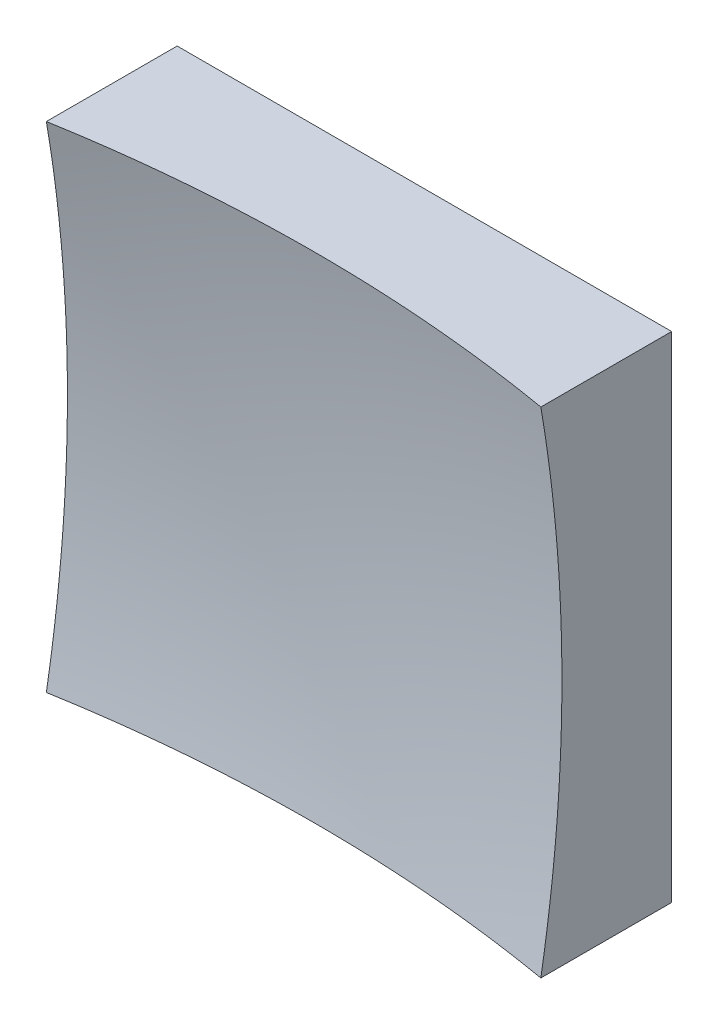
ISO-10303-21;
HEADER;
FILE_DESCRIPTION(('STEP AP214'),'2;1');
FILE_NAME('part.step','',(''),(''),'','','');
FILE_SCHEMA(('AUTOMOTIVE_DESIGN { 1 0 10303 214 1 1 1 1 }'));
ENDSEC;
DATA;
#1=APPLICATION_CONTEXT('core data for automotive mechanical design processes');
#2=APPLICATION_PROTOCOL_DEFINITION('international standard','automotive_design',2000,#1);
#3=PRODUCT_CONTEXT('',#1,'mechanical');
#4=PRODUCT('Part','Part','',(#3));
#5=PRODUCT_RELATED_PRODUCT_CATEGORY('part','',(#4));
#6=PRODUCT_DEFINITION_FORMATION('','',#4);
#7=PRODUCT_DEFINITION_CONTEXT('part definition',#1,'design');
#8=PRODUCT_DEFINITION('design','',#6,#7);
#9=PRODUCT_DEFINITION_SHAPE('','',#8);
#10=(LENGTH_UNIT() NAMED_UNIT(*) SI_UNIT(.MILLI.,.METRE.));
#11=(NAMED_UNIT(*) PLANE_ANGLE_UNIT() SI_UNIT($,.RADIAN.));
#12=(NAMED_UNIT(*) SI_UNIT($,.STERADIAN.) SOLID_ANGLE_UNIT());
#13=UNCERTAINTY_MEASURE_WITH_UNIT(LENGTH_MEASURE(1.E-05),#10,'distance_accuracy_value','');
#14=(GEOMETRIC_REPRESENTATION_CONTEXT(3) GLOBAL_UNCERTAINTY_ASSIGNED_CONTEXT((#13)) GLOBAL_UNIT_ASSIGNED_CONTEXT((#10,
#11,#12)) REPRESENTATION_CONTEXT('',''));
#15=CARTESIAN_POINT('',(0.,0.,0.));
#16=DIRECTION('',(0.,0.,1.));
#17=DIRECTION('',(1.,0.,0.));
#18=AXIS2_PLACEMENT_3D('',#15,#16,#17);
#19=CARTESIAN_POINT('',(-25.,25.,50.));
#20=DIRECTION('',(0.,1.,0.));
#21=DIRECTION('',(0.,0.,1.));
#22=AXIS2_PLACEMENT_3D('',#19,#20,#21);
#23=PLANE('',#22);
#24=CARTESIAN_POINT('',(0.,25.,159.));
#25=DIRECTION('',(0.,1.,0.));
#26=DIRECTION('',(0.,0.,1.));
#27=AXIS2_PLACEMENT_3D('',#24,#25,#26);
#28=CIRCLE('',#27,147.90199457749);
#29=CARTESIAN_POINT('',(25.,25.,13.2262026288675));
#30=VERTEX_POINT('',#29);
#31=CARTESIAN_POINT('',(-25.,25.,13.2262026288675));
#32=VERTEX_POINT('',#31);
#33=EDGE_CURVE('E79',#30,#32,#28,.T.);
#34=ORIENTED_EDGE('',*,*,#33,.F.);
#35=DIRECTION('',(0.,0.,-1.));
#36=VECTOR('',#35,1.);
#37=CARTESIAN_POINT('',(25.,25.,50.));
#38=LINE('',#37,#36);
#39=CARTESIAN_POINT('',(25.,25.,0.));
#40=VERTEX_POINT('',#39);
#41=EDGE_CURVE('E85',#30,#40,#38,.T.);
#42=ORIENTED_EDGE('',*,*,#41,.T.);
#43=DIRECTION('',(1.,0.,0.));
#44=VECTOR('',#43,1.);
#45=CARTESIAN_POINT('',(-25.,25.,0.));
#46=LINE('',#45,#44);
#47=CARTESIAN_POINT('',(-25.,25.,0.));
#48=VERTEX_POINT('',#47);
#49=EDGE_CURVE('E88',#48,#40,#46,.T.);
#50=ORIENTED_EDGE('',*,*,#49,.F.);
#51=DIRECTION('',(0.,0.,-1.));
#52=VECTOR('',#51,1.);
#53=CARTESIAN_POINT('',(-25.,25.,50.));
#54=LINE('',#53,#52);
#55=EDGE_CURVE('E47',#32,#48,#54,.T.);
#56=ORIENTED_EDGE('',*,*,#55,.F.);
#57=EDGE_LOOP('',(#34,#42,#50,#56));
#58=FACE_BOUND('',#57,.T.);
#59=ADVANCED_FACE('F39',(#58),#23,.T.);
#60=CARTESIAN_POINT('',(-25.,25.,50.));
#61=DIRECTION('',(1.,0.,0.));
#62=DIRECTION('',(0.,1.,0.));
#63=AXIS2_PLACEMENT_3D('',#60,#61,#62);
#64=PLANE('',#63);
#65=DIRECTION('',(0.,0.,-1.));
#66=VECTOR('',#65,1.);
#67=CARTESIAN_POINT('',(-25.,-25.,50.));
#68=LINE('',#67,#66);
#69=CARTESIAN_POINT('',(-25.,-25.,13.2262026288675));
#70=VERTEX_POINT('',#69);
#71=CARTESIAN_POINT('',(-25.,-25.,0.));
#72=VERTEX_POINT('',#71);
#73=EDGE_CURVE('E100',#70,#72,#68,.T.);
#74=ORIENTED_EDGE('',*,*,#73,.F.);
#75=CARTESIAN_POINT('',(-25.,0.,159.));
#76=DIRECTION('',(1.,0.,0.));
#77=DIRECTION('',(0.,1.,0.));
#78=AXIS2_PLACEMENT_3D('',#75,#76,#77);
#79=CIRCLE('',#78,147.90199457749);
#80=EDGE_CURVE('E89',#70,#32,#79,.T.);
#81=ORIENTED_EDGE('',*,*,#80,.T.);
#82=ORIENTED_EDGE('',*,*,#55,.T.);
#83=DIRECTION('',(0.,-1.,0.));
#84=VECTOR('',#83,1.);
#85=CARTESIAN_POINT('',(-25.,25.,0.));
#86=LINE('',#85,#84);
#87=EDGE_CURVE('E97',#48,#72,#86,.T.);
#88=ORIENTED_EDGE('',*,*,#87,.T.);
#89=EDGE_LOOP('',(#74,#81,#82,#88));
#90=FACE_BOUND('',#89,.T.);
#91=ADVANCED_FACE('F122',(#90),#64,.F.);
#92=CARTESIAN_POINT('',(-25.,-25.,50.));
#93=DIRECTION('',(0.,1.,0.));
#94=DIRECTION('',(0.,0.,1.));
#95=AXIS2_PLACEMENT_3D('',#92,#93,#94);
#96=PLANE('',#95);
#97=DIRECTION('',(0.,0.,-1.));
#98=VECTOR('',#97,1.);
#99=CARTESIAN_POINT('',(25.,-25.,50.));
#100=LINE('',#99,#98);
#101=CARTESIAN_POINT('',(25.,-25.,13.2262026288675));
#102=VERTEX_POINT('',#101);
#103=CARTESIAN_POINT('',(25.,-25.,0.));
#104=VERTEX_POINT('',#103);
#105=EDGE_CURVE('E96',#102,#104,#100,.T.);
#106=ORIENTED_EDGE('',*,*,#105,.F.);
#107=CARTESIAN_POINT('',(0.,-25.,159.));
#108=DIRECTION('',(0.,1.,0.));
#109=DIRECTION('',(0.,0.,1.));
#110=AXIS2_PLACEMENT_3D('',#107,#108,#109);
#111=CIRCLE('',#110,147.90199457749);
#112=EDGE_CURVE('E53',#102,#70,#111,.T.);
#113=ORIENTED_EDGE('',*,*,#112,.T.);
#114=ORIENTED_EDGE('',*,*,#73,.T.);
#115=DIRECTION('',(1.,0.,0.));
#116=VECTOR('',#115,1.);
#117=CARTESIAN_POINT('',(-25.,-25.,0.));
#118=LINE('',#117,#116);
#119=EDGE_CURVE('E102',#72,#104,#118,.T.);
#120=ORIENTED_EDGE('',*,*,#119,.T.);
#121=EDGE_LOOP('',(#106,#113,#114,#120));
#122=FACE_BOUND('',#121,.T.);
#123=ADVANCED_FACE('F121',(#122),#96,.F.);
#124=CARTESIAN_POINT('',(25.,25.,50.));
#125=DIRECTION('',(1.,0.,0.));
#126=DIRECTION('',(0.,1.,0.));
#127=AXIS2_PLACEMENT_3D('',#124,#125,#126);
#128=PLANE('',#127);
#129=CARTESIAN_POINT('',(25.,0.,159.));
#130=DIRECTION('',(1.,0.,0.));
#131=DIRECTION('',(0.,1.,0.));
#132=AXIS2_PLACEMENT_3D('',#129,#130,#131);
#133=CIRCLE('',#132,147.90199457749);
#134=EDGE_CURVE('E11',#102,#30,#133,.T.);
#135=ORIENTED_EDGE('',*,*,#134,.F.);
#136=ORIENTED_EDGE('',*,*,#105,.T.);
#137=DIRECTION('',(0.,-1.,0.));
#138=VECTOR('',#137,1.);
#139=CARTESIAN_POINT('',(25.,25.,0.));
#140=LINE('',#139,#138);
#141=EDGE_CURVE('E93',#40,#104,#140,.T.);
#142=ORIENTED_EDGE('',*,*,#141,.F.);
#143=ORIENTED_EDGE('',*,*,#41,.F.);
#144=EDGE_LOOP('',(#135,#136,#142,#143));
#145=FACE_BOUND('',#144,.T.);
#146=ADVANCED_FACE('F91',(#145),#128,.T.);
#147=CARTESIAN_POINT('',(0.,0.,0.));
#148=DIRECTION('',(0.,0.,-1.));
#149=DIRECTION('',(-1.,0.,0.));
#150=AXIS2_PLACEMENT_3D('',#147,#148,#149);
#151=PLANE('',#150);
#152=ORIENTED_EDGE('',*,*,#49,.T.);
#153=ORIENTED_EDGE('',*,*,#141,.T.);
#154=ORIENTED_EDGE('',*,*,#119,.F.);
#155=ORIENTED_EDGE('',*,*,#87,.F.);
#156=EDGE_LOOP('',(#152,#153,#154,#155));
#157=FACE_BOUND('',#156,.T.);
#158=ADVANCED_FACE('F125',(#157),#151,.T.);
#159=CARTESIAN_POINT('',(0.,0.,159.));
#160=DIRECTION('',(0.,0.,1.));
#161=DIRECTION('',(1.,0.,0.));
#162=AXIS2_PLACEMENT_3D('',#159,#160,#161);
#163=SPHERICAL_SURFACE('',#162,150.);
#164=ORIENTED_EDGE('',*,*,#33,.T.);
#165=ORIENTED_EDGE('',*,*,#80,.F.);
#166=ORIENTED_EDGE('',*,*,#112,.F.);
#167=ORIENTED_EDGE('',*,*,#134,.T.);
#168=EDGE_LOOP('',(#164,#165,#166,#167));
#169=FACE_BOUND('',#168,.T.);
#170=ADVANCED_FACE('F78',(#169),#163,.F.);
#171=CLOSED_SHELL('',(#59,#91,#123,#146,#158,#170));
#172=MANIFOLD_SOLID_BREP('B2',#171);
#173=ADVANCED_BREP_SHAPE_REPRESENTATION('',(#18,#172),#14);
#174=SHAPE_DEFINITION_REPRESENTATION(#9,#173);
ENDSEC;
END-ISO-10303-21;
